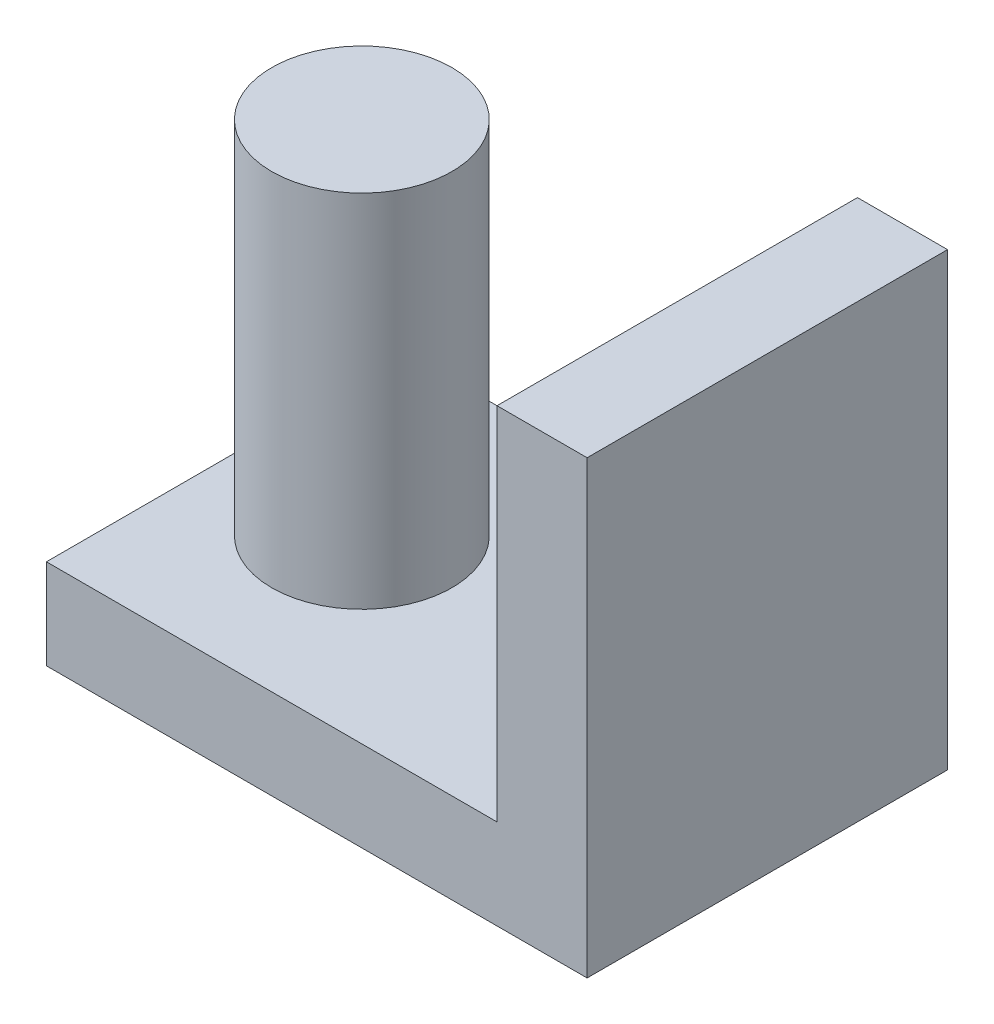
ISO-10303-21;
HEADER;
FILE_DESCRIPTION(('STEP AP214'),'2;1');
FILE_NAME('part.step','',(''),(''),'','','');
FILE_SCHEMA(('AUTOMOTIVE_DESIGN { 1 0 10303 214 1 1 1 1 }'));
ENDSEC;
DATA;
#1=APPLICATION_CONTEXT('core data for automotive mechanical design processes');
#2=APPLICATION_PROTOCOL_DEFINITION('international standard','automotive_design',2000,#1);
#3=PRODUCT_CONTEXT('',#1,'mechanical');
#4=PRODUCT('Part','Part','',(#3));
#5=PRODUCT_RELATED_PRODUCT_CATEGORY('part','',(#4));
#6=PRODUCT_DEFINITION_FORMATION('','',#4);
#7=PRODUCT_DEFINITION_CONTEXT('part definition',#1,'design');
#8=PRODUCT_DEFINITION('design','',#6,#7);
#9=PRODUCT_DEFINITION_SHAPE('','',#8);
#10=(LENGTH_UNIT() NAMED_UNIT(*) SI_UNIT(.MILLI.,.METRE.));
#11=(NAMED_UNIT(*) PLANE_ANGLE_UNIT() SI_UNIT($,.RADIAN.));
#12=(NAMED_UNIT(*) SI_UNIT($,.STERADIAN.) SOLID_ANGLE_UNIT());
#13=UNCERTAINTY_MEASURE_WITH_UNIT(LENGTH_MEASURE(1.E-05),#10,'distance_accuracy_value','');
#14=(GEOMETRIC_REPRESENTATION_CONTEXT(3) GLOBAL_UNCERTAINTY_ASSIGNED_CONTEXT((#13)) GLOBAL_UNIT_ASSIGNED_CONTEXT((#10,
#11,#12)) REPRESENTATION_CONTEXT('',''));
#15=CARTESIAN_POINT('',(0.,0.,0.));
#16=DIRECTION('',(0.,0.,1.));
#17=DIRECTION('',(1.,0.,0.));
#18=AXIS2_PLACEMENT_3D('',#15,#16,#17);
#19=CARTESIAN_POINT('',(0.,1.5875,0.));
#20=DIRECTION('',(0.,1.,0.));
#21=DIRECTION('',(0.,0.,1.));
#22=AXIS2_PLACEMENT_3D('',#19,#20,#21);
#23=PLANE('',#22);
#24=CARTESIAN_POINT('',(-2.38125,1.5875,0.));
#25=DIRECTION('',(0.,1.,0.));
#26=DIRECTION('',(0.,0.,1.));
#27=AXIS2_PLACEMENT_3D('',#24,#25,#26);
#28=CIRCLE('',#27,1.5875);
#29=CARTESIAN_POINT('',(-2.38125,1.5875,1.5875));
#30=VERTEX_POINT('',#29);
#31=EDGE_CURVE('E115',#30,#30,#28,.T.);
#32=ORIENTED_EDGE('',*,*,#31,.F.);
#33=EDGE_LOOP('',(#32));
#34=FACE_BOUND('',#33,.T.);
#35=DIRECTION('',(1.,0.,0.));
#36=VECTOR('',#35,1.);
#37=CARTESIAN_POINT('',(-4.76249999999999,1.5875,3.175));
#38=LINE('',#37,#36);
#39=CARTESIAN_POINT('',(-4.76249999999999,1.5875,3.175));
#40=VERTEX_POINT('',#39);
#41=CARTESIAN_POINT('',(3.17500000000001,1.5875,3.175));
#42=VERTEX_POINT('',#41);
#43=EDGE_CURVE('E50',#40,#42,#38,.T.);
#44=ORIENTED_EDGE('',*,*,#43,.T.);
#45=DIRECTION('',(0.,0.,1.));
#46=VECTOR('',#45,1.);
#47=CARTESIAN_POINT('',(3.175,1.5875,-3.175));
#48=LINE('',#47,#46);
#49=CARTESIAN_POINT('',(3.175,1.5875,-3.175));
#50=VERTEX_POINT('',#49);
#51=EDGE_CURVE('E54',#50,#42,#48,.T.);
#52=ORIENTED_EDGE('',*,*,#51,.F.);
#53=DIRECTION('',(-1.,0.,0.));
#54=VECTOR('',#53,1.);
#55=CARTESIAN_POINT('',(-4.7625,1.5875,-3.175));
#56=LINE('',#55,#54);
#57=CARTESIAN_POINT('',(-4.7625,1.5875,-3.175));
#58=VERTEX_POINT('',#57);
#59=EDGE_CURVE('E121',#50,#58,#56,.T.);
#60=ORIENTED_EDGE('',*,*,#59,.T.);
#61=DIRECTION('',(0.,0.,1.));
#62=VECTOR('',#61,1.);
#63=CARTESIAN_POINT('',(-4.7625,1.5875,-3.175));
#64=LINE('',#63,#62);
#65=EDGE_CURVE('E123',#58,#40,#64,.T.);
#66=ORIENTED_EDGE('',*,*,#65,.T.);
#67=EDGE_LOOP('',(#44,#52,#60,#66));
#68=FACE_BOUND('',#67,.T.);
#69=ADVANCED_FACE('F35',(#34,#68),#23,.T.);
#70=CARTESIAN_POINT('',(4.7625,1.5875,-3.175));
#71=DIRECTION('',(-1.,0.,0.));
#72=DIRECTION('',(0.,0.,1.));
#73=AXIS2_PLACEMENT_3D('',#70,#71,#72);
#74=PLANE('',#73);
#75=DIRECTION('',(0.,0.,-1.));
#76=VECTOR('',#75,1.);
#77=CARTESIAN_POINT('',(4.7625,0.,-3.175));
#78=LINE('',#77,#76);
#79=CARTESIAN_POINT('',(4.76250000000001,0.,3.175));
#80=VERTEX_POINT('',#79);
#81=CARTESIAN_POINT('',(4.7625,0.,-3.175));
#82=VERTEX_POINT('',#81);
#83=EDGE_CURVE('E91',#80,#82,#78,.T.);
#84=ORIENTED_EDGE('',*,*,#83,.T.);
#85=DIRECTION('',(0.,-1.,0.));
#86=VECTOR('',#85,1.);
#87=CARTESIAN_POINT('',(4.7625,1.5875,-3.175));
#88=LINE('',#87,#86);
#89=CARTESIAN_POINT('',(4.7625,7.9375,-3.175));
#90=VERTEX_POINT('',#89);
#91=EDGE_CURVE('E11',#90,#82,#88,.T.);
#92=ORIENTED_EDGE('',*,*,#91,.F.);
#93=DIRECTION('',(0.,0.,-1.));
#94=VECTOR('',#93,1.);
#95=CARTESIAN_POINT('',(4.7625,7.9375,-3.175));
#96=LINE('',#95,#94);
#97=CARTESIAN_POINT('',(4.7625,7.9375,3.175));
#98=VERTEX_POINT('',#97);
#99=EDGE_CURVE('E89',#98,#90,#96,.T.);
#100=ORIENTED_EDGE('',*,*,#99,.F.);
#101=DIRECTION('',(0.,-1.,0.));
#102=VECTOR('',#101,1.);
#103=CARTESIAN_POINT('',(4.76250000000001,1.5875,3.175));
#104=LINE('',#103,#102);
#105=EDGE_CURVE('E127',#98,#80,#104,.T.);
#106=ORIENTED_EDGE('',*,*,#105,.T.);
#107=EDGE_LOOP('',(#84,#92,#100,#106));
#108=FACE_BOUND('',#107,.T.);
#109=ADVANCED_FACE('F37',(#108),#74,.F.);
#110=CARTESIAN_POINT('',(-4.7625,1.5875,-3.175));
#111=DIRECTION('',(0.,0.,1.));
#112=DIRECTION('',(1.,0.,0.));
#113=AXIS2_PLACEMENT_3D('',#110,#111,#112);
#114=PLANE('',#113);
#115=DIRECTION('',(-1.,0.,0.));
#116=VECTOR('',#115,1.);
#117=CARTESIAN_POINT('',(-4.7625,0.,-3.175));
#118=LINE('',#117,#116);
#119=CARTESIAN_POINT('',(-4.7625,0.,-3.175));
#120=VERTEX_POINT('',#119);
#121=EDGE_CURVE('E129',#82,#120,#118,.T.);
#122=ORIENTED_EDGE('',*,*,#121,.T.);
#123=DIRECTION('',(0.,-1.,0.));
#124=VECTOR('',#123,1.);
#125=CARTESIAN_POINT('',(-4.7625,1.5875,-3.175));
#126=LINE('',#125,#124);
#127=EDGE_CURVE('E43',#58,#120,#126,.T.);
#128=ORIENTED_EDGE('',*,*,#127,.F.);
#129=ORIENTED_EDGE('',*,*,#59,.F.);
#130=DIRECTION('',(0.,-1.,0.));
#131=VECTOR('',#130,1.);
#132=CARTESIAN_POINT('',(3.175,7.9375,-3.175));
#133=LINE('',#132,#131);
#134=CARTESIAN_POINT('',(3.175,7.9375,-3.175));
#135=VERTEX_POINT('',#134);
#136=EDGE_CURVE('E97',#135,#50,#133,.T.);
#137=ORIENTED_EDGE('',*,*,#136,.F.);
#138=DIRECTION('',(-1.,0.,0.));
#139=VECTOR('',#138,1.);
#140=CARTESIAN_POINT('',(4.7625,7.9375,-3.175));
#141=LINE('',#140,#139);
#142=EDGE_CURVE('E94',#90,#135,#141,.T.);
#143=ORIENTED_EDGE('',*,*,#142,.F.);
#144=ORIENTED_EDGE('',*,*,#91,.T.);
#145=EDGE_LOOP('',(#122,#128,#129,#137,#143,#144));
#146=FACE_BOUND('',#145,.T.);
#147=ADVANCED_FACE('F95',(#146),#114,.F.);
#148=CARTESIAN_POINT('',(-4.7625,1.5875,-3.175));
#149=DIRECTION('',(1.,0.,0.));
#150=DIRECTION('',(0.,0.,-1.));
#151=AXIS2_PLACEMENT_3D('',#148,#149,#150);
#152=PLANE('',#151);
#153=DIRECTION('',(0.,0.,1.));
#154=VECTOR('',#153,1.);
#155=CARTESIAN_POINT('',(-4.7625,0.,-3.175));
#156=LINE('',#155,#154);
#157=CARTESIAN_POINT('',(-4.76249999999999,0.,3.175));
#158=VERTEX_POINT('',#157);
#159=EDGE_CURVE('E131',#120,#158,#156,.T.);
#160=ORIENTED_EDGE('',*,*,#159,.T.);
#161=DIRECTION('',(0.,-1.,0.));
#162=VECTOR('',#161,1.);
#163=CARTESIAN_POINT('',(-4.76249999999999,1.5875,3.175));
#164=LINE('',#163,#162);
#165=EDGE_CURVE('E135',#40,#158,#164,.T.);
#166=ORIENTED_EDGE('',*,*,#165,.F.);
#167=ORIENTED_EDGE('',*,*,#65,.F.);
#168=ORIENTED_EDGE('',*,*,#127,.T.);
#169=EDGE_LOOP('',(#160,#166,#167,#168));
#170=FACE_BOUND('',#169,.T.);
#171=ADVANCED_FACE('F142',(#170),#152,.F.);
#172=CARTESIAN_POINT('',(-4.76249999999999,1.5875,3.175));
#173=DIRECTION('',(0.,0.,-1.));
#174=DIRECTION('',(-1.,0.,0.));
#175=AXIS2_PLACEMENT_3D('',#172,#173,#174);
#176=PLANE('',#175);
#177=DIRECTION('',(1.,0.,0.));
#178=VECTOR('',#177,1.);
#179=CARTESIAN_POINT('',(-4.76249999999999,0.,3.175));
#180=LINE('',#179,#178);
#181=EDGE_CURVE('E124',#158,#80,#180,.T.);
#182=ORIENTED_EDGE('',*,*,#181,.T.);
#183=ORIENTED_EDGE('',*,*,#105,.F.);
#184=DIRECTION('',(1.,0.,0.));
#185=VECTOR('',#184,1.);
#186=CARTESIAN_POINT('',(4.7625,7.9375,3.175));
#187=LINE('',#186,#185);
#188=CARTESIAN_POINT('',(3.17500000000001,7.9375,3.175));
#189=VERTEX_POINT('',#188);
#190=EDGE_CURVE('E105',#189,#98,#187,.T.);
#191=ORIENTED_EDGE('',*,*,#190,.F.);
#192=DIRECTION('',(0.,-1.,0.));
#193=VECTOR('',#192,1.);
#194=CARTESIAN_POINT('',(3.17500000000001,7.9375,3.175));
#195=LINE('',#194,#193);
#196=EDGE_CURVE('E110',#189,#42,#195,.T.);
#197=ORIENTED_EDGE('',*,*,#196,.T.);
#198=ORIENTED_EDGE('',*,*,#43,.F.);
#199=ORIENTED_EDGE('',*,*,#165,.T.);
#200=EDGE_LOOP('',(#182,#183,#191,#197,#198,#199));
#201=FACE_BOUND('',#200,.T.);
#202=ADVANCED_FACE('F148',(#201),#176,.F.);
#203=CARTESIAN_POINT('',(0.,0.,0.));
#204=DIRECTION('',(0.,1.,0.));
#205=DIRECTION('',(0.,0.,1.));
#206=AXIS2_PLACEMENT_3D('',#203,#204,#205);
#207=PLANE('',#206);
#208=ORIENTED_EDGE('',*,*,#83,.F.);
#209=ORIENTED_EDGE('',*,*,#181,.F.);
#210=ORIENTED_EDGE('',*,*,#159,.F.);
#211=ORIENTED_EDGE('',*,*,#121,.F.);
#212=EDGE_LOOP('',(#208,#209,#210,#211));
#213=FACE_BOUND('',#212,.T.);
#214=ADVANCED_FACE('F146',(#213),#207,.F.);
#215=CARTESIAN_POINT('',(-2.38125,7.9375,0.));
#216=DIRECTION('',(0.,-1.,0.));
#217=DIRECTION('',(0.,0.,-1.));
#218=AXIS2_PLACEMENT_3D('',#215,#216,#217);
#219=CYLINDRICAL_SURFACE('',#218,1.5875);
#220=CARTESIAN_POINT('',(-2.38125,7.9375,0.));
#221=DIRECTION('',(0.,1.,0.));
#222=DIRECTION('',(0.,0.,1.));
#223=AXIS2_PLACEMENT_3D('',#220,#221,#222);
#224=CIRCLE('',#223,1.5875);
#225=CARTESIAN_POINT('',(-2.38125,7.9375,1.5875));
#226=VERTEX_POINT('',#225);
#227=EDGE_CURVE('E116',#226,#226,#224,.T.);
#228=ORIENTED_EDGE('',*,*,#227,.F.);
#229=EDGE_LOOP('',(#228));
#230=FACE_BOUND('',#229,.T.);
#231=ORIENTED_EDGE('',*,*,#31,.T.);
#232=EDGE_LOOP('',(#231));
#233=FACE_BOUND('',#232,.T.);
#234=ADVANCED_FACE('F160',(#230,#233),#219,.T.);
#235=CARTESIAN_POINT('',(-2.38125,7.9375,0.));
#236=DIRECTION('',(0.,1.,0.));
#237=DIRECTION('',(0.,0.,1.));
#238=AXIS2_PLACEMENT_3D('',#235,#236,#237);
#239=PLANE('',#238);
#240=ORIENTED_EDGE('',*,*,#227,.T.);
#241=EDGE_LOOP('',(#240));
#242=FACE_BOUND('',#241,.T.);
#243=ADVANCED_FACE('F153',(#242),#239,.T.);
#244=CARTESIAN_POINT('',(3.175,7.9375,-3.175));
#245=DIRECTION('',(1.,0.,0.));
#246=DIRECTION('',(0.,0.,-1.));
#247=AXIS2_PLACEMENT_3D('',#244,#245,#246);
#248=PLANE('',#247);
#249=ORIENTED_EDGE('',*,*,#51,.T.);
#250=ORIENTED_EDGE('',*,*,#196,.F.);
#251=DIRECTION('',(0.,0.,1.));
#252=VECTOR('',#251,1.);
#253=CARTESIAN_POINT('',(3.175,7.9375,-3.175));
#254=LINE('',#253,#252);
#255=EDGE_CURVE('E100',#135,#189,#254,.T.);
#256=ORIENTED_EDGE('',*,*,#255,.F.);
#257=ORIENTED_EDGE('',*,*,#136,.T.);
#258=EDGE_LOOP('',(#249,#250,#256,#257));
#259=FACE_BOUND('',#258,.T.);
#260=ADVANCED_FACE('F151',(#259),#248,.F.);
#261=CARTESIAN_POINT('',(0.,7.9375,0.));
#262=DIRECTION('',(0.,-1.,0.));
#263=DIRECTION('',(0.,0.,-1.));
#264=AXIS2_PLACEMENT_3D('',#261,#262,#263);
#265=PLANE('',#264);
#266=ORIENTED_EDGE('',*,*,#99,.T.);
#267=ORIENTED_EDGE('',*,*,#142,.T.);
#268=ORIENTED_EDGE('',*,*,#255,.T.);
#269=ORIENTED_EDGE('',*,*,#190,.T.);
#270=EDGE_LOOP('',(#266,#267,#268,#269));
#271=FACE_BOUND('',#270,.T.);
#272=ADVANCED_FACE('F103',(#271),#265,.F.);
#273=CLOSED_SHELL('',(#69,#109,#147,#171,#202,#214,#234,#243,#260,#272));
#274=MANIFOLD_SOLID_BREP('B2',#273);
#275=ADVANCED_BREP_SHAPE_REPRESENTATION('',(#18,#274),#14);
#276=SHAPE_DEFINITION_REPRESENTATION(#9,#275);
ENDSEC;
END-ISO-10303-21;
